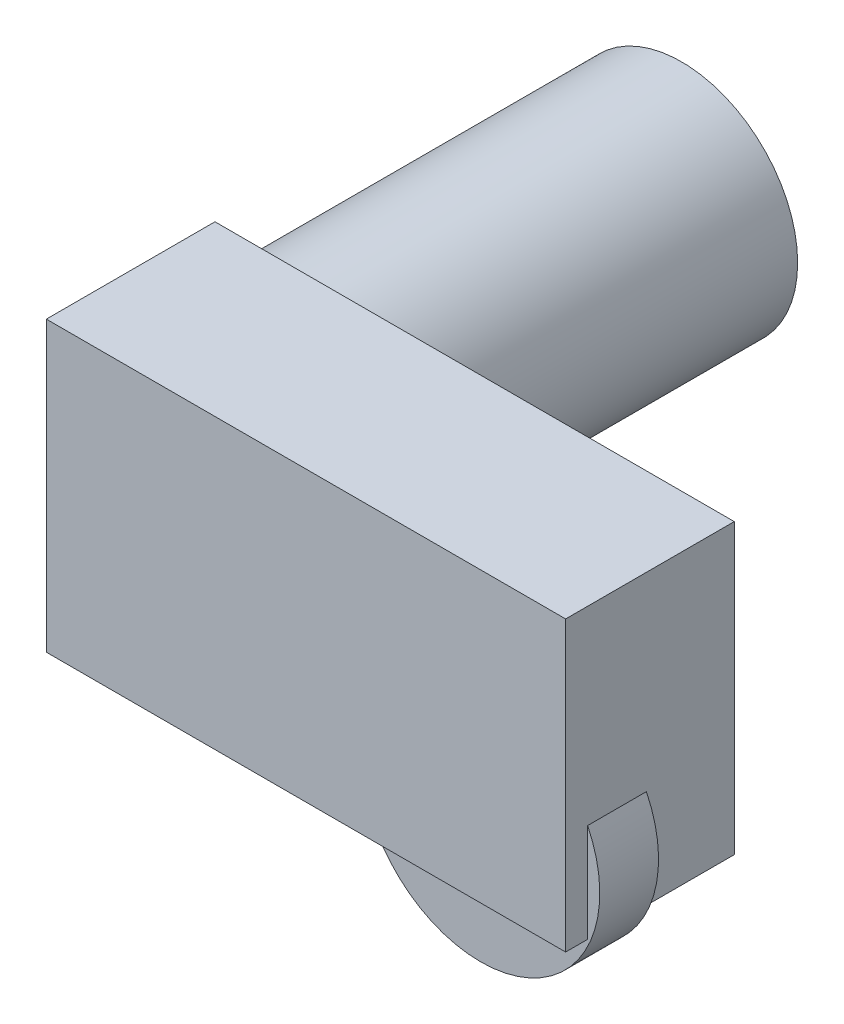
ISO-10303-21;
HEADER;
FILE_DESCRIPTION(('STEP AP214'),'2;1');
FILE_NAME('part.step','',(''),(''),'','','');
FILE_SCHEMA(('AUTOMOTIVE_DESIGN { 1 0 10303 214 1 1 1 1 }'));
ENDSEC;
DATA;
#1=APPLICATION_CONTEXT('core data for automotive mechanical design processes');
#2=APPLICATION_PROTOCOL_DEFINITION('international standard','automotive_design',2000,#1);
#3=PRODUCT_CONTEXT('',#1,'mechanical');
#4=PRODUCT('Part','Part','',(#3));
#5=PRODUCT_RELATED_PRODUCT_CATEGORY('part','',(#4));
#6=PRODUCT_DEFINITION_FORMATION('','',#4);
#7=PRODUCT_DEFINITION_CONTEXT('part definition',#1,'design');
#8=PRODUCT_DEFINITION('design','',#6,#7);
#9=PRODUCT_DEFINITION_SHAPE('','',#8);
#10=(LENGTH_UNIT() NAMED_UNIT(*) SI_UNIT(.MILLI.,.METRE.));
#11=(NAMED_UNIT(*) PLANE_ANGLE_UNIT() SI_UNIT($,.RADIAN.));
#12=(NAMED_UNIT(*) SI_UNIT($,.STERADIAN.) SOLID_ANGLE_UNIT());
#13=UNCERTAINTY_MEASURE_WITH_UNIT(LENGTH_MEASURE(1.E-05),#10,'distance_accuracy_value','');
#14=(GEOMETRIC_REPRESENTATION_CONTEXT(3) GLOBAL_UNCERTAINTY_ASSIGNED_CONTEXT((#13)) GLOBAL_UNIT_ASSIGNED_CONTEXT((#10,
#11,#12)) REPRESENTATION_CONTEXT('',''));
#15=CARTESIAN_POINT('',(0.,0.,0.));
#16=DIRECTION('',(0.,0.,1.));
#17=DIRECTION('',(1.,0.,0.));
#18=AXIS2_PLACEMENT_3D('',#15,#16,#17);
#19=CARTESIAN_POINT('',(62.5414024105058,-7.55077319146769,0.));
#20=DIRECTION('',(0.,0.,1.));
#21=DIRECTION('',(-1.,0.,0.));
#22=AXIS2_PLACEMENT_3D('',#19,#20,#21);
#23=PLANE('',#22);
#24=CARTESIAN_POINT('',(-9.08017470120266,18.5374457641994,0.));
#25=DIRECTION('',(0.,0.,-1.));
#26=DIRECTION('',(-1.,0.,0.));
#27=AXIS2_PLACEMENT_3D('',#24,#25,#26);
#28=CIRCLE('',#27,19.);
#29=CARTESIAN_POINT('',(-22.4585975894942,32.0288430610711,0.));
#30=VERTEX_POINT('',#29);
#31=CARTESIAN_POINT('',(-22.4585975894942,5.04604846732777,0.));
#32=VERTEX_POINT('',#31);
#33=EDGE_CURVE('E130',#30,#32,#28,.T.);
#34=ORIENTED_EDGE('',*,*,#33,.F.);
#35=DIRECTION('',(0.,1.,0.));
#36=VECTOR('',#35,1.);
#37=CARTESIAN_POINT('',(-22.4585975894942,39.669557012058,0.));
#38=LINE('',#37,#36);
#39=CARTESIAN_POINT('',(-22.4585975894942,39.669557012058,0.));
#40=VERTEX_POINT('',#39);
#41=EDGE_CURVE('E164',#30,#40,#38,.T.);
#42=ORIENTED_EDGE('',*,*,#41,.T.);
#43=DIRECTION('',(1.,0.,0.));
#44=VECTOR('',#43,1.);
#45=CARTESIAN_POINT('',(62.5414024105058,39.669557012058,0.));
#46=LINE('',#45,#44);
#47=CARTESIAN_POINT('',(62.5414024105058,39.669557012058,0.));
#48=VERTEX_POINT('',#47);
#49=EDGE_CURVE('E156',#40,#48,#46,.T.);
#50=ORIENTED_EDGE('',*,*,#49,.T.);
#51=DIRECTION('',(0.,-1.,0.));
#52=VECTOR('',#51,1.);
#53=CARTESIAN_POINT('',(62.5414024105058,39.669557012058,0.));
#54=LINE('',#53,#52);
#55=CARTESIAN_POINT('',(62.5414024105058,-7.55077319146769,0.));
#56=VERTEX_POINT('',#55);
#57=EDGE_CURVE('E168',#48,#56,#54,.T.);
#58=ORIENTED_EDGE('',*,*,#57,.T.);
#59=DIRECTION('',(-1.,0.,0.));
#60=VECTOR('',#59,1.);
#61=CARTESIAN_POINT('',(62.5414024105058,-7.55077319146769,0.));
#62=LINE('',#61,#60);
#63=CARTESIAN_POINT('',(-22.4585975894942,-7.55077319146769,0.));
#64=VERTEX_POINT('',#63);
#65=EDGE_CURVE('E165',#56,#64,#62,.T.);
#66=ORIENTED_EDGE('',*,*,#65,.T.);
#67=EDGE_CURVE('E160',#64,#32,#38,.T.);
#68=ORIENTED_EDGE('',*,*,#67,.T.);
#69=EDGE_LOOP('',(#34,#42,#50,#58,#66,#68));
#70=FACE_BOUND('',#69,.T.);
#71=ADVANCED_FACE('F30',(#70),#23,.F.);
#72=CARTESIAN_POINT('',(62.5414024105058,39.669557012058,27.6));
#73=DIRECTION('',(-1.,0.,0.));
#74=DIRECTION('',(0.,0.,-1.));
#75=AXIS2_PLACEMENT_3D('',#72,#73,#74);
#76=PLANE('',#75);
#77=DIRECTION('',(0.,0.,-1.));
#78=VECTOR('',#77,1.);
#79=CARTESIAN_POINT('',(62.5414024105058,8.5791283346381,24.));
#80=LINE('',#79,#78);
#81=CARTESIAN_POINT('',(62.5414024105058,8.5791283346381,24.));
#82=VERTEX_POINT('',#81);
#83=CARTESIAN_POINT('',(62.5414024105058,8.5791283346381,14.38));
#84=VERTEX_POINT('',#83);
#85=EDGE_CURVE('E171',#82,#84,#80,.T.);
#86=ORIENTED_EDGE('',*,*,#85,.T.);
#87=DIRECTION('',(0.,-1.,0.));
#88=VECTOR('',#87,1.);
#89=CARTESIAN_POINT('',(62.5414024105058,39.669557012058,14.38));
#90=LINE('',#89,#88);
#91=CARTESIAN_POINT('',(62.5414024105058,-7.55077319146769,14.38));
#92=VERTEX_POINT('',#91);
#93=EDGE_CURVE('E111',#84,#92,#90,.T.);
#94=ORIENTED_EDGE('',*,*,#93,.T.);
#95=DIRECTION('',(0.,0.,-1.));
#96=VECTOR('',#95,1.);
#97=CARTESIAN_POINT('',(62.5414024105058,-7.55077319146769,27.6));
#98=LINE('',#97,#96);
#99=EDGE_CURVE('E120',#92,#56,#98,.T.);
#100=ORIENTED_EDGE('',*,*,#99,.T.);
#101=ORIENTED_EDGE('',*,*,#57,.F.);
#102=DIRECTION('',(0.,0.,-1.));
#103=VECTOR('',#102,1.);
#104=CARTESIAN_POINT('',(62.5414024105058,39.669557012058,27.6));
#105=LINE('',#104,#103);
#106=CARTESIAN_POINT('',(62.5414024105058,39.669557012058,27.6));
#107=VERTEX_POINT('',#106);
#108=EDGE_CURVE('E153',#107,#48,#105,.T.);
#109=ORIENTED_EDGE('',*,*,#108,.F.);
#110=DIRECTION('',(0.,-1.,0.));
#111=VECTOR('',#110,1.);
#112=CARTESIAN_POINT('',(62.5414024105058,39.669557012058,27.6));
#113=LINE('',#112,#111);
#114=CARTESIAN_POINT('',(62.5414024105058,-7.55077319146769,27.6));
#115=VERTEX_POINT('',#114);
#116=EDGE_CURVE('E159',#107,#115,#113,.T.);
#117=ORIENTED_EDGE('',*,*,#116,.T.);
#118=CARTESIAN_POINT('',(62.5414024105058,-7.55077319146769,24.));
#119=VERTEX_POINT('',#118);
#120=EDGE_CURVE('E146',#115,#119,#98,.T.);
#121=ORIENTED_EDGE('',*,*,#120,.T.);
#122=DIRECTION('',(0.,-1.,0.));
#123=VECTOR('',#122,1.);
#124=CARTESIAN_POINT('',(62.5414024105058,39.669557012058,24.));
#125=LINE('',#124,#123);
#126=EDGE_CURVE('E182',#82,#119,#125,.T.);
#127=ORIENTED_EDGE('',*,*,#126,.F.);
#128=EDGE_LOOP('',(#86,#94,#100,#101,#109,#117,#121,#127));
#129=FACE_BOUND('',#128,.T.);
#130=ADVANCED_FACE('F186',(#129),#76,.F.);
#131=CARTESIAN_POINT('',(62.5414024105058,-7.55077319146769,27.6));
#132=DIRECTION('',(0.,1.,0.));
#133=DIRECTION('',(0.,0.,1.));
#134=AXIS2_PLACEMENT_3D('',#131,#132,#133);
#135=PLANE('',#134);
#136=ORIENTED_EDGE('',*,*,#120,.F.);
#137=DIRECTION('',(-1.,0.,0.));
#138=VECTOR('',#137,1.);
#139=CARTESIAN_POINT('',(62.5414024105058,-7.55077319146769,27.6));
#140=LINE('',#139,#138);
#141=CARTESIAN_POINT('',(-22.4585975894942,-7.55077319146769,27.6));
#142=VERTEX_POINT('',#141);
#143=EDGE_CURVE('E176',#115,#142,#140,.T.);
#144=ORIENTED_EDGE('',*,*,#143,.T.);
#145=DIRECTION('',(0.,0.,-1.));
#146=VECTOR('',#145,1.);
#147=CARTESIAN_POINT('',(-22.4585975894942,-7.55077319146769,27.6));
#148=LINE('',#147,#146);
#149=EDGE_CURVE('E149',#142,#64,#148,.T.);
#150=ORIENTED_EDGE('',*,*,#149,.T.);
#151=ORIENTED_EDGE('',*,*,#65,.F.);
#152=ORIENTED_EDGE('',*,*,#99,.F.);
#153=DIRECTION('',(-1.,0.,0.));
#154=VECTOR('',#153,1.);
#155=CARTESIAN_POINT('',(62.5414024105058,-7.55077319146769,14.38));
#156=LINE('',#155,#154);
#157=CARTESIAN_POINT('',(27.0512584060541,-7.55077319146769,14.38));
#158=VERTEX_POINT('',#157);
#159=EDGE_CURVE('E108',#92,#158,#156,.T.);
#160=ORIENTED_EDGE('',*,*,#159,.T.);
#161=DIRECTION('',(0.,0.,-1.));
#162=VECTOR('',#161,1.);
#163=CARTESIAN_POINT('',(27.0512584060541,-7.55077319146769,24.));
#164=LINE('',#163,#162);
#165=CARTESIAN_POINT('',(27.0512584060541,-7.55077319146769,24.));
#166=VERTEX_POINT('',#165);
#167=EDGE_CURVE('E38',#158,#166,#164,.F.);
#168=ORIENTED_EDGE('',*,*,#167,.T.);
#169=DIRECTION('',(-1.,0.,0.));
#170=VECTOR('',#169,1.);
#171=CARTESIAN_POINT('',(62.5414024105058,-7.55077319146769,24.));
#172=LINE('',#171,#170);
#173=EDGE_CURVE('E11',#119,#166,#172,.T.);
#174=ORIENTED_EDGE('',*,*,#173,.F.);
#175=EDGE_LOOP('',(#136,#144,#150,#151,#152,#160,#168,#174));
#176=FACE_BOUND('',#175,.T.);
#177=ADVANCED_FACE('F118',(#176),#135,.F.);
#178=CARTESIAN_POINT('',(-22.4585975894942,39.669557012058,27.6));
#179=DIRECTION('',(1.,0.,0.));
#180=DIRECTION('',(0.,-1.,0.));
#181=AXIS2_PLACEMENT_3D('',#178,#179,#180);
#182=PLANE('',#181);
#183=ORIENTED_EDGE('',*,*,#67,.F.);
#184=ORIENTED_EDGE('',*,*,#149,.F.);
#185=DIRECTION('',(0.,1.,0.));
#186=VECTOR('',#185,1.);
#187=CARTESIAN_POINT('',(-22.4585975894942,39.669557012058,27.6));
#188=LINE('',#187,#186);
#189=CARTESIAN_POINT('',(-22.4585975894942,39.669557012058,27.6));
#190=VERTEX_POINT('',#189);
#191=EDGE_CURVE('E173',#142,#190,#188,.T.);
#192=ORIENTED_EDGE('',*,*,#191,.T.);
#193=DIRECTION('',(0.,0.,-1.));
#194=VECTOR('',#193,1.);
#195=CARTESIAN_POINT('',(-22.4585975894942,39.669557012058,27.6));
#196=LINE('',#195,#194);
#197=EDGE_CURVE('E151',#190,#40,#196,.T.);
#198=ORIENTED_EDGE('',*,*,#197,.T.);
#199=ORIENTED_EDGE('',*,*,#41,.F.);
#200=EDGE_CURVE('E163',#32,#30,#38,.T.);
#201=ORIENTED_EDGE('',*,*,#200,.F.);
#202=EDGE_LOOP('',(#183,#184,#192,#198,#199,#201));
#203=FACE_BOUND('',#202,.T.);
#204=ADVANCED_FACE('F197',(#203),#182,.F.);
#205=CARTESIAN_POINT('',(62.5414024105058,39.669557012058,27.6));
#206=DIRECTION('',(0.,-1.,0.));
#207=DIRECTION('',(0.,0.,-1.));
#208=AXIS2_PLACEMENT_3D('',#205,#206,#207);
#209=PLANE('',#208);
#210=ORIENTED_EDGE('',*,*,#49,.F.);
#211=ORIENTED_EDGE('',*,*,#197,.F.);
#212=DIRECTION('',(1.,0.,0.));
#213=VECTOR('',#212,1.);
#214=CARTESIAN_POINT('',(62.5414024105058,39.669557012058,27.6));
#215=LINE('',#214,#213);
#216=EDGE_CURVE('E155',#190,#107,#215,.T.);
#217=ORIENTED_EDGE('',*,*,#216,.T.);
#218=ORIENTED_EDGE('',*,*,#108,.T.);
#219=EDGE_LOOP('',(#210,#211,#217,#218));
#220=FACE_BOUND('',#219,.T.);
#221=ADVANCED_FACE('F205',(#220),#209,.F.);
#222=CARTESIAN_POINT('',(62.5414024105058,-7.55077319146769,27.6));
#223=DIRECTION('',(0.,0.,1.));
#224=DIRECTION('',(-1.,0.,0.));
#225=AXIS2_PLACEMENT_3D('',#222,#223,#224);
#226=PLANE('',#225);
#227=ORIENTED_EDGE('',*,*,#116,.F.);
#228=ORIENTED_EDGE('',*,*,#216,.F.);
#229=ORIENTED_EDGE('',*,*,#191,.F.);
#230=ORIENTED_EDGE('',*,*,#143,.F.);
#231=EDGE_LOOP('',(#227,#228,#229,#230));
#232=FACE_BOUND('',#231,.T.);
#233=ADVANCED_FACE('F192',(#232),#226,.T.);
#234=CARTESIAN_POINT('',(21.1862419644348,17.1813946890512,-63.));
#235=DIRECTION('',(0.,0.,1.));
#236=DIRECTION('',(-1.,0.,0.));
#237=AXIS2_PLACEMENT_3D('',#234,#235,#236);
#238=CYLINDRICAL_SURFACE('',#237,21.15);
#239=CARTESIAN_POINT('',(21.1862419644348,17.1813946890512,0.));
#240=DIRECTION('',(0.,0.,-1.));
#241=DIRECTION('',(-1.,0.,0.));
#242=AXIS2_PLACEMENT_3D('',#239,#240,#241);
#243=CIRCLE('',#242,21.15);
#244=CARTESIAN_POINT('',(0.140259901825004,19.2764219013581,0.));
#245=VERTEX_POINT('',#244);
#246=CARTESIAN_POINT('',(0.0372309394255036,16.9768643391397,0.));
#247=VERTEX_POINT('',#246);
#248=EDGE_CURVE('E137',#245,#247,#243,.F.);
#249=ORIENTED_EDGE('',*,*,#248,.T.);
#250=DIRECTION('',(0.,0.,1.));
#251=VECTOR('',#250,1.);
#252=CARTESIAN_POINT('',(0.0372309394255019,16.9768643391397,-63.));
#253=LINE('',#252,#251);
#254=CARTESIAN_POINT('',(0.0372309394255019,16.9768643391397,-63.));
#255=VERTEX_POINT('',#254);
#256=EDGE_CURVE('E121',#255,#247,#253,.T.);
#257=ORIENTED_EDGE('',*,*,#256,.F.);
#258=CARTESIAN_POINT('',(21.1862419644348,17.1813946890512,-63.));
#259=DIRECTION('',(0.,0.,-1.));
#260=DIRECTION('',(-1.,0.,0.));
#261=AXIS2_PLACEMENT_3D('',#258,#259,#260);
#262=CIRCLE('',#261,21.15);
#263=CARTESIAN_POINT('',(0.140259901825004,19.2764219013581,-63.));
#264=VERTEX_POINT('',#263);
#265=EDGE_CURVE('E140',#255,#264,#262,.T.);
#266=ORIENTED_EDGE('',*,*,#265,.T.);
#267=DIRECTION('',(0.,0.,1.));
#268=VECTOR('',#267,1.);
#269=CARTESIAN_POINT('',(0.140259901825004,19.2764219013581,-63.));
#270=LINE('',#269,#268);
#271=EDGE_CURVE('E124',#264,#245,#270,.T.);
#272=ORIENTED_EDGE('',*,*,#271,.T.);
#273=EDGE_LOOP('',(#249,#257,#266,#272));
#274=FACE_BOUND('',#273,.T.);
#275=ADVANCED_FACE('F212',(#274),#238,.F.);
#276=CARTESIAN_POINT('',(19.9295775037876,-71.9989985881213,0.));
#277=DIRECTION('',(0.,0.,1.));
#278=DIRECTION('',(-1.,0.,0.));
#279=AXIS2_PLACEMENT_3D('',#276,#277,#278);
#280=PLANE('',#279);
#281=EDGE_CURVE('E134',#32,#30,#28,.T.);
#282=ORIENTED_EDGE('',*,*,#281,.F.);
#283=ORIENTED_EDGE('',*,*,#200,.T.);
#284=EDGE_LOOP('',(#282,#283));
#285=FACE_BOUND('',#284,.T.);
#286=ADVANCED_FACE('F210',(#285),#280,.T.);
#287=CARTESIAN_POINT('',(-9.08017470120266,18.5374457641994,-63.));
#288=DIRECTION('',(0.,0.,1.));
#289=DIRECTION('',(-1.,0.,0.));
#290=AXIS2_PLACEMENT_3D('',#287,#288,#289);
#291=CYLINDRICAL_SURFACE('',#290,9.24999999999999);
#292=CARTESIAN_POINT('',(-9.08017470120266,18.5374457641994,0.));
#293=DIRECTION('',(0.,0.,-1.));
#294=DIRECTION('',(-1.,0.,0.));
#295=AXIS2_PLACEMENT_3D('',#292,#293,#294);
#296=CIRCLE('',#295,9.24999999999999);
#297=EDGE_CURVE('E135',#245,#247,#296,.T.);
#298=ORIENTED_EDGE('',*,*,#297,.F.);
#299=ORIENTED_EDGE('',*,*,#271,.F.);
#300=CARTESIAN_POINT('',(-9.08017470120266,18.5374457641994,-63.));
#301=DIRECTION('',(0.,0.,-1.));
#302=DIRECTION('',(-1.,0.,0.));
#303=AXIS2_PLACEMENT_3D('',#300,#301,#302);
#304=CIRCLE('',#303,9.24999999999999);
#305=EDGE_CURVE('E133',#264,#255,#304,.T.);
#306=ORIENTED_EDGE('',*,*,#305,.T.);
#307=ORIENTED_EDGE('',*,*,#256,.T.);
#308=EDGE_LOOP('',(#298,#299,#306,#307));
#309=FACE_BOUND('',#308,.T.);
#310=ADVANCED_FACE('F32',(#309),#291,.F.);
#311=CARTESIAN_POINT('',(-9.08017470120266,18.5374457641994,-63.));
#312=DIRECTION('',(0.,0.,1.));
#313=DIRECTION('',(-1.,0.,0.));
#314=AXIS2_PLACEMENT_3D('',#311,#312,#313);
#315=CYLINDRICAL_SURFACE('',#314,19.);
#316=CARTESIAN_POINT('',(-9.08017470120266,18.5374457641994,-63.));
#317=DIRECTION('',(0.,0.,-1.));
#318=DIRECTION('',(-1.,0.,0.));
#319=AXIS2_PLACEMENT_3D('',#316,#317,#318);
#320=CIRCLE('',#319,19.);
#321=CARTESIAN_POINT('',(-28.0801747012027,18.5374457641994,-63.));
#322=VERTEX_POINT('',#321);
#323=EDGE_CURVE('E128',#322,#322,#320,.T.);
#324=ORIENTED_EDGE('',*,*,#323,.F.);
#325=EDGE_LOOP('',(#324));
#326=FACE_BOUND('',#325,.T.);
#327=ORIENTED_EDGE('',*,*,#33,.T.);
#328=ORIENTED_EDGE('',*,*,#281,.T.);
#329=EDGE_LOOP('',(#327,#328));
#330=FACE_BOUND('',#329,.T.);
#331=ADVANCED_FACE('F208',(#326,#330),#315,.T.);
#332=CARTESIAN_POINT('',(19.9295775037876,-71.9989985881213,-63.));
#333=DIRECTION('',(0.,0.,1.));
#334=DIRECTION('',(-1.,0.,0.));
#335=AXIS2_PLACEMENT_3D('',#332,#333,#334);
#336=PLANE('',#335);
#337=ORIENTED_EDGE('',*,*,#305,.F.);
#338=ORIENTED_EDGE('',*,*,#265,.F.);
#339=EDGE_LOOP('',(#337,#338));
#340=FACE_BOUND('',#339,.T.);
#341=ORIENTED_EDGE('',*,*,#323,.T.);
#342=EDGE_LOOP('',(#341));
#343=FACE_BOUND('',#342,.T.);
#344=ADVANCED_FACE('F232',(#340,#343),#336,.F.);
#345=ORIENTED_EDGE('',*,*,#248,.F.);
#346=ORIENTED_EDGE('',*,*,#297,.T.);
#347=EDGE_LOOP('',(#345,#346));
#348=FACE_BOUND('',#347,.T.);
#349=ADVANCED_FACE('F224',(#348),#23,.F.);
#350=CARTESIAN_POINT('',(45.0300187696335,0.,24.));
#351=DIRECTION('',(0.,0.,-1.));
#352=DIRECTION('',(1.,0.,0.));
#353=AXIS2_PLACEMENT_3D('',#350,#351,#352);
#354=CYLINDRICAL_SURFACE('',#353,19.5);
#355=CARTESIAN_POINT('',(45.0300187696335,0.,24.));
#356=DIRECTION('',(0.,0.,-1.));
#357=DIRECTION('',(-1.,0.,0.));
#358=AXIS2_PLACEMENT_3D('',#355,#356,#357);
#359=CIRCLE('',#358,19.5);
#360=EDGE_CURVE('E44',#82,#166,#359,.T.);
#361=ORIENTED_EDGE('',*,*,#360,.T.);
#362=ORIENTED_EDGE('',*,*,#167,.F.);
#363=CARTESIAN_POINT('',(45.0300187696335,0.,14.38));
#364=DIRECTION('',(0.,0.,-1.));
#365=DIRECTION('',(-1.,0.,0.));
#366=AXIS2_PLACEMENT_3D('',#363,#364,#365);
#367=CIRCLE('',#366,19.5);
#368=EDGE_CURVE('E52',#84,#158,#367,.T.);
#369=ORIENTED_EDGE('',*,*,#368,.F.);
#370=ORIENTED_EDGE('',*,*,#85,.F.);
#371=EDGE_LOOP('',(#361,#362,#369,#370));
#372=FACE_BOUND('',#371,.T.);
#373=ADVANCED_FACE('F115',(#372),#354,.T.);
#374=CARTESIAN_POINT('',(32.0387692987252,-58.7947184610287,24.));
#375=DIRECTION('',(0.,0.,1.));
#376=DIRECTION('',(-1.,0.,0.));
#377=AXIS2_PLACEMENT_3D('',#374,#375,#376);
#378=PLANE('',#377);
#379=ORIENTED_EDGE('',*,*,#126,.T.);
#380=ORIENTED_EDGE('',*,*,#173,.T.);
#381=ORIENTED_EDGE('',*,*,#360,.F.);
#382=EDGE_LOOP('',(#379,#380,#381));
#383=FACE_BOUND('',#382,.T.);
#384=ADVANCED_FACE('F188',(#383),#378,.T.);
#385=CARTESIAN_POINT('',(32.0387692987252,-58.7947184610287,14.38));
#386=DIRECTION('',(0.,0.,1.));
#387=DIRECTION('',(-1.,0.,0.));
#388=AXIS2_PLACEMENT_3D('',#385,#386,#387);
#389=PLANE('',#388);
#390=ORIENTED_EDGE('',*,*,#368,.T.);
#391=ORIENTED_EDGE('',*,*,#159,.F.);
#392=ORIENTED_EDGE('',*,*,#93,.F.);
#393=EDGE_LOOP('',(#390,#391,#392));
#394=FACE_BOUND('',#393,.T.);
#395=ADVANCED_FACE('F106',(#394),#389,.F.);
#396=CLOSED_SHELL('',(#71,#130,#177,#204,#221,#233,#275,#286,#310,#331,#344,#349,#373,#384,#395));
#397=MANIFOLD_SOLID_BREP('B2',#396);
#398=ADVANCED_BREP_SHAPE_REPRESENTATION('',(#18,#397),#14);
#399=SHAPE_DEFINITION_REPRESENTATION(#9,#398);
ENDSEC;
END-ISO-10303-21;
